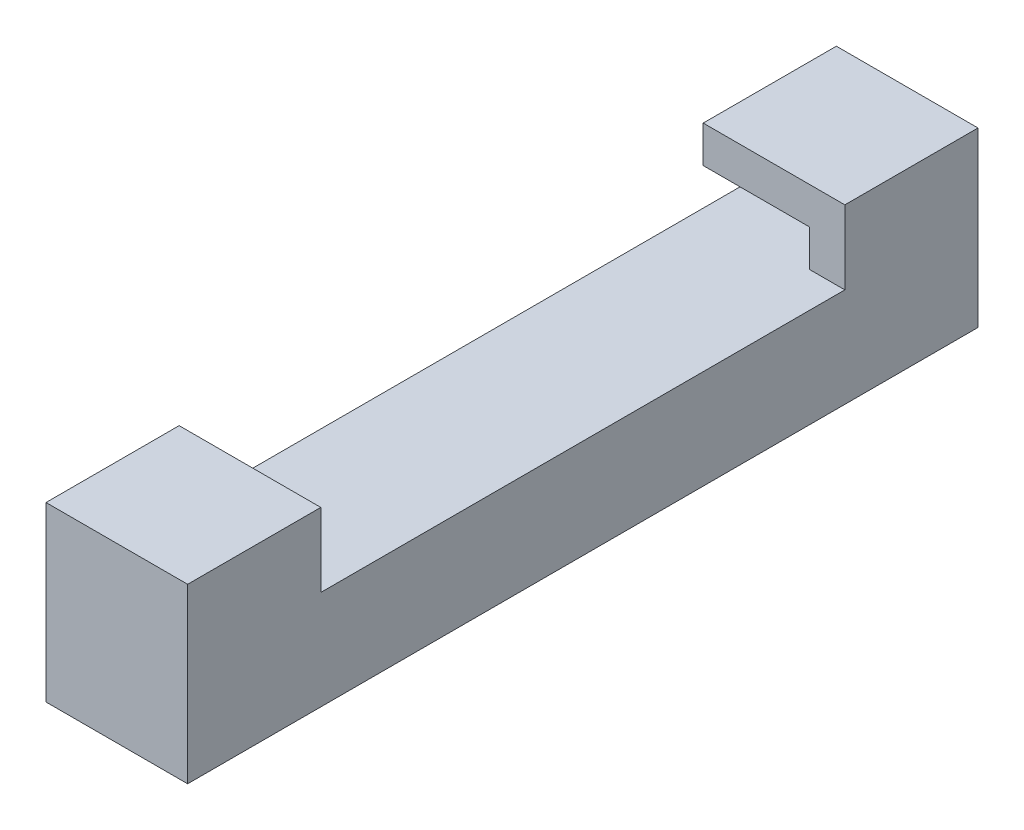
ISO-10303-21;
HEADER;
FILE_DESCRIPTION(('STEP AP214'),'2;1');
FILE_NAME('part.step','',(''),(''),'','','');
FILE_SCHEMA(('AUTOMOTIVE_DESIGN { 1 0 10303 214 1 1 1 1 }'));
ENDSEC;
DATA;
#1=APPLICATION_CONTEXT('core data for automotive mechanical design processes');
#2=APPLICATION_PROTOCOL_DEFINITION('international standard','automotive_design',2000,#1);
#3=PRODUCT_CONTEXT('',#1,'mechanical');
#4=PRODUCT('Part','Part','',(#3));
#5=PRODUCT_RELATED_PRODUCT_CATEGORY('part','',(#4));
#6=PRODUCT_DEFINITION_FORMATION('','',#4);
#7=PRODUCT_DEFINITION_CONTEXT('part definition',#1,'design');
#8=PRODUCT_DEFINITION('design','',#6,#7);
#9=PRODUCT_DEFINITION_SHAPE('','',#8);
#10=(LENGTH_UNIT() NAMED_UNIT(*) SI_UNIT(.MILLI.,.METRE.));
#11=(NAMED_UNIT(*) PLANE_ANGLE_UNIT() SI_UNIT($,.RADIAN.));
#12=(NAMED_UNIT(*) SI_UNIT($,.STERADIAN.) SOLID_ANGLE_UNIT());
#13=UNCERTAINTY_MEASURE_WITH_UNIT(LENGTH_MEASURE(1.E-05),#10,'distance_accuracy_value','');
#14=(GEOMETRIC_REPRESENTATION_CONTEXT(3) GLOBAL_UNCERTAINTY_ASSIGNED_CONTEXT((#13)) GLOBAL_UNIT_ASSIGNED_CONTEXT((#10,
#11,#12)) REPRESENTATION_CONTEXT('',''));
#15=CARTESIAN_POINT('',(0.,0.,0.));
#16=DIRECTION('',(0.,0.,1.));
#17=DIRECTION('',(1.,0.,0.));
#18=AXIS2_PLACEMENT_3D('',#15,#16,#17);
#19=CARTESIAN_POINT('',(12.7,12.192,-63.5));
#20=DIRECTION('',(0.,-1.,0.));
#21=DIRECTION('',(0.,0.,-1.));
#22=AXIS2_PLACEMENT_3D('',#19,#20,#21);
#23=PLANE('',#22);
#24=DIRECTION('',(-1.,0.,0.));
#25=VECTOR('',#24,1.);
#26=CARTESIAN_POINT('',(12.7,12.192,-70.612));
#27=LINE('',#26,#25);
#28=CARTESIAN_POINT('',(9.525,12.192,-70.612));
#29=VERTEX_POINT('',#28);
#30=CARTESIAN_POINT('',(0.,12.192,-70.612));
#31=VERTEX_POINT('',#30);
#32=EDGE_CURVE('E167',#29,#31,#27,.T.);
#33=ORIENTED_EDGE('',*,*,#32,.F.);
#34=DIRECTION('',(0.,0.,1.));
#35=VECTOR('',#34,1.);
#36=CARTESIAN_POINT('',(9.525,12.192,-70.612));
#37=LINE('',#36,#35);
#38=CARTESIAN_POINT('',(9.525,12.192,-63.5));
#39=VERTEX_POINT('',#38);
#40=EDGE_CURVE('E203',#29,#39,#37,.T.);
#41=ORIENTED_EDGE('',*,*,#40,.T.);
#42=DIRECTION('',(-1.,0.,0.));
#43=VECTOR('',#42,1.);
#44=CARTESIAN_POINT('',(12.7,12.192,-63.5));
#45=LINE('',#44,#43);
#46=CARTESIAN_POINT('',(0.,12.192,-63.5));
#47=VERTEX_POINT('',#46);
#48=EDGE_CURVE('E166',#39,#47,#45,.T.);
#49=ORIENTED_EDGE('',*,*,#48,.T.);
#50=DIRECTION('',(0.,0.,1.));
#51=VECTOR('',#50,1.);
#52=CARTESIAN_POINT('',(0.,12.192,-63.5));
#53=LINE('',#52,#51);
#54=EDGE_CURVE('E176',#31,#47,#53,.T.);
#55=ORIENTED_EDGE('',*,*,#54,.F.);
#56=EDGE_LOOP('',(#33,#41,#49,#55));
#57=FACE_BOUND('',#56,.T.);
#58=ADVANCED_FACE('F33',(#57),#23,.T.);
#59=CARTESIAN_POINT('',(12.7,8.89,-70.612));
#60=DIRECTION('',(0.,0.,1.));
#61=DIRECTION('',(1.,0.,0.));
#62=AXIS2_PLACEMENT_3D('',#59,#60,#61);
#63=PLANE('',#62);
#64=DIRECTION('',(-1.,0.,0.));
#65=VECTOR('',#64,1.);
#66=CARTESIAN_POINT('',(12.7,8.89,-70.612));
#67=LINE('',#66,#65);
#68=CARTESIAN_POINT('',(9.525,8.89,-70.612));
#69=VERTEX_POINT('',#68);
#70=CARTESIAN_POINT('',(0.,8.89,-70.612));
#71=VERTEX_POINT('',#70);
#72=EDGE_CURVE('E173',#69,#71,#67,.T.);
#73=ORIENTED_EDGE('',*,*,#72,.F.);
#74=DIRECTION('',(0.,1.,0.));
#75=VECTOR('',#74,1.);
#76=CARTESIAN_POINT('',(9.525,8.89,-70.612));
#77=LINE('',#76,#75);
#78=EDGE_CURVE('E209',#69,#29,#77,.T.);
#79=ORIENTED_EDGE('',*,*,#78,.T.);
#80=ORIENTED_EDGE('',*,*,#32,.T.);
#81=DIRECTION('',(0.,1.,0.));
#82=VECTOR('',#81,1.);
#83=CARTESIAN_POINT('',(0.,8.89,-70.612));
#84=LINE('',#83,#82);
#85=EDGE_CURVE('E195',#71,#31,#84,.T.);
#86=ORIENTED_EDGE('',*,*,#85,.F.);
#87=EDGE_LOOP('',(#73,#79,#80,#86));
#88=FACE_BOUND('',#87,.T.);
#89=ADVANCED_FACE('F287',(#88),#63,.T.);
#90=CARTESIAN_POINT('',(12.7,0.,0.));
#91=DIRECTION('',(0.,1.,0.));
#92=DIRECTION('',(0.,0.,1.));
#93=AXIS2_PLACEMENT_3D('',#90,#91,#92);
#94=PLANE('',#93);
#95=DIRECTION('',(0.,0.,-1.));
#96=VECTOR('',#95,1.);
#97=CARTESIAN_POINT('',(12.7,0.,0.));
#98=LINE('',#97,#96);
#99=CARTESIAN_POINT('',(12.7,0.,-4.572));
#100=VERTEX_POINT('',#99);
#101=CARTESIAN_POINT('',(12.7,0.,-75.438));
#102=VERTEX_POINT('',#101);
#103=EDGE_CURVE('E42',#100,#102,#98,.T.);
#104=ORIENTED_EDGE('',*,*,#103,.F.);
#105=DIRECTION('',(-1.,0.,0.));
#106=VECTOR('',#105,1.);
#107=CARTESIAN_POINT('',(12.701,0.,-4.572));
#108=LINE('',#107,#106);
#109=CARTESIAN_POINT('',(0.,0.,-4.572));
#110=VERTEX_POINT('',#109);
#111=EDGE_CURVE('E136',#100,#110,#108,.T.);
#112=ORIENTED_EDGE('',*,*,#111,.T.);
#113=DIRECTION('',(0.,0.,-1.));
#114=VECTOR('',#113,1.);
#115=CARTESIAN_POINT('',(0.,0.,0.));
#116=LINE('',#115,#114);
#117=CARTESIAN_POINT('',(0.,0.,-75.438));
#118=VERTEX_POINT('',#117);
#119=EDGE_CURVE('E162',#110,#118,#116,.T.);
#120=ORIENTED_EDGE('',*,*,#119,.T.);
#121=DIRECTION('',(-1.,0.,0.));
#122=VECTOR('',#121,1.);
#123=CARTESIAN_POINT('',(12.701,0.,-75.438));
#124=LINE('',#123,#122);
#125=EDGE_CURVE('E159',#102,#118,#124,.T.);
#126=ORIENTED_EDGE('',*,*,#125,.F.);
#127=EDGE_LOOP('',(#104,#112,#120,#126));
#128=FACE_BOUND('',#127,.T.);
#129=ADVANCED_FACE('F35',(#128),#94,.F.);
#130=CARTESIAN_POINT('',(12.7,8.89,-71.12));
#131=DIRECTION('',(0.,-1.,0.));
#132=DIRECTION('',(0.,0.,-1.));
#133=AXIS2_PLACEMENT_3D('',#130,#131,#132);
#134=PLANE('',#133);
#135=DIRECTION('',(0.,0.,1.));
#136=VECTOR('',#135,1.);
#137=CARTESIAN_POINT('',(12.7,8.89,-71.12));
#138=LINE('',#137,#136);
#139=CARTESIAN_POINT('',(12.7,8.89,-63.5));
#140=VERTEX_POINT('',#139);
#141=CARTESIAN_POINT('',(12.7,8.88999999999999,-16.51));
#142=VERTEX_POINT('',#141);
#143=EDGE_CURVE('E11',#140,#142,#138,.T.);
#144=ORIENTED_EDGE('',*,*,#143,.F.);
#145=DIRECTION('',(1.,0.,0.));
#146=VECTOR('',#145,1.);
#147=CARTESIAN_POINT('',(9.525,8.89,-63.5));
#148=LINE('',#147,#146);
#149=CARTESIAN_POINT('',(9.525,8.89,-63.5));
#150=VERTEX_POINT('',#149);
#151=EDGE_CURVE('E50',#150,#140,#148,.T.);
#152=ORIENTED_EDGE('',*,*,#151,.F.);
#153=DIRECTION('',(0.,0.,-1.));
#154=VECTOR('',#153,1.);
#155=CARTESIAN_POINT('',(9.525,8.89,-63.5));
#156=LINE('',#155,#154);
#157=EDGE_CURVE('E213',#150,#69,#156,.T.);
#158=ORIENTED_EDGE('',*,*,#157,.T.);
#159=ORIENTED_EDGE('',*,*,#72,.T.);
#160=DIRECTION('',(0.,0.,1.));
#161=VECTOR('',#160,1.);
#162=CARTESIAN_POINT('',(0.,8.89,-71.12));
#163=LINE('',#162,#161);
#164=CARTESIAN_POINT('',(0.,8.88999999999999,-9.398));
#165=VERTEX_POINT('',#164);
#166=EDGE_CURVE('E37',#71,#165,#163,.T.);
#167=ORIENTED_EDGE('',*,*,#166,.T.);
#168=DIRECTION('',(-1.,0.,0.));
#169=VECTOR('',#168,1.);
#170=CARTESIAN_POINT('',(12.7,8.88999999999999,-9.398));
#171=LINE('',#170,#169);
#172=CARTESIAN_POINT('',(9.525,8.88999999999999,-9.398));
#173=VERTEX_POINT('',#172);
#174=EDGE_CURVE('E257',#173,#165,#171,.T.);
#175=ORIENTED_EDGE('',*,*,#174,.F.);
#176=DIRECTION('',(0.,0.,-1.));
#177=VECTOR('',#176,1.);
#178=CARTESIAN_POINT('',(9.525,8.88999999999999,-16.51));
#179=LINE('',#178,#177);
#180=CARTESIAN_POINT('',(9.525,8.88999999999999,-16.51));
#181=VERTEX_POINT('',#180);
#182=EDGE_CURVE('E223',#173,#181,#179,.T.);
#183=ORIENTED_EDGE('',*,*,#182,.T.);
#184=DIRECTION('',(1.,0.,0.));
#185=VECTOR('',#184,1.);
#186=CARTESIAN_POINT('',(9.525,8.88999999999999,-16.51));
#187=LINE('',#186,#185);
#188=EDGE_CURVE('E155',#181,#142,#187,.T.);
#189=ORIENTED_EDGE('',*,*,#188,.T.);
#190=EDGE_LOOP('',(#144,#152,#158,#159,#167,#175,#183,#189));
#191=FACE_BOUND('',#190,.T.);
#192=ADVANCED_FACE('F274',(#191),#134,.F.);
#193=CARTESIAN_POINT('',(12.7,0.,0.));
#194=DIRECTION('',(1.,0.,0.));
#195=DIRECTION('',(0.,0.,-1.));
#196=AXIS2_PLACEMENT_3D('',#193,#194,#195);
#197=PLANE('',#196);
#198=DIRECTION('',(0.,1.,0.));
#199=VECTOR('',#198,1.);
#200=CARTESIAN_POINT('',(12.7,12.192,-63.5));
#201=LINE('',#200,#199);
#202=CARTESIAN_POINT('',(12.7,15.494,-63.5));
#203=VERTEX_POINT('',#202);
#204=EDGE_CURVE('E57',#140,#203,#201,.T.);
#205=ORIENTED_EDGE('',*,*,#204,.F.);
#206=ORIENTED_EDGE('',*,*,#143,.T.);
#207=DIRECTION('',(0.,-1.,0.));
#208=VECTOR('',#207,1.);
#209=CARTESIAN_POINT('',(12.7,12.192,-16.51));
#210=LINE('',#209,#208);
#211=CARTESIAN_POINT('',(12.7,15.494,-16.51));
#212=VERTEX_POINT('',#211);
#213=EDGE_CURVE('E240',#212,#142,#210,.T.);
#214=ORIENTED_EDGE('',*,*,#213,.F.);
#215=DIRECTION('',(0.,0.,-1.));
#216=VECTOR('',#215,1.);
#217=CARTESIAN_POINT('',(12.7,15.494,-16.51));
#218=LINE('',#217,#216);
#219=CARTESIAN_POINT('',(12.7,15.494,-4.572));
#220=VERTEX_POINT('',#219);
#221=EDGE_CURVE('E154',#220,#212,#218,.T.);
#222=ORIENTED_EDGE('',*,*,#221,.F.);
#223=DIRECTION('',(0.,-1.,0.));
#224=VECTOR('',#223,1.);
#225=CARTESIAN_POINT('',(12.7,15.494,-4.572));
#226=LINE('',#225,#224);
#227=EDGE_CURVE('E140',#220,#100,#226,.T.);
#228=ORIENTED_EDGE('',*,*,#227,.T.);
#229=ORIENTED_EDGE('',*,*,#103,.T.);
#230=DIRECTION('',(0.,1.,0.));
#231=VECTOR('',#230,1.);
#232=CARTESIAN_POINT('',(12.7,15.494,-75.438));
#233=LINE('',#232,#231);
#234=CARTESIAN_POINT('',(12.7,15.494,-75.438));
#235=VERTEX_POINT('',#234);
#236=EDGE_CURVE('E147',#102,#235,#233,.T.);
#237=ORIENTED_EDGE('',*,*,#236,.T.);
#238=DIRECTION('',(0.,0.,-1.));
#239=VECTOR('',#238,1.);
#240=CARTESIAN_POINT('',(12.7,15.494,-63.5));
#241=LINE('',#240,#239);
#242=EDGE_CURVE('E180',#203,#235,#241,.T.);
#243=ORIENTED_EDGE('',*,*,#242,.F.);
#244=EDGE_LOOP('',(#205,#206,#214,#222,#228,#229,#237,#243));
#245=FACE_BOUND('',#244,.T.);
#246=ADVANCED_FACE('F150',(#245),#197,.T.);
#247=CARTESIAN_POINT('',(0.,0.,0.));
#248=DIRECTION('',(1.,0.,0.));
#249=DIRECTION('',(0.,0.,-1.));
#250=AXIS2_PLACEMENT_3D('',#247,#248,#249);
#251=PLANE('',#250);
#252=ORIENTED_EDGE('',*,*,#119,.F.);
#253=DIRECTION('',(0.,-1.,0.));
#254=VECTOR('',#253,1.);
#255=CARTESIAN_POINT('',(0.,15.494,-4.572));
#256=LINE('',#255,#254);
#257=CARTESIAN_POINT('',(0.,15.494,-4.572));
#258=VERTEX_POINT('',#257);
#259=EDGE_CURVE('E143',#258,#110,#256,.T.);
#260=ORIENTED_EDGE('',*,*,#259,.F.);
#261=DIRECTION('',(0.,0.,-1.));
#262=VECTOR('',#261,1.);
#263=CARTESIAN_POINT('',(0.,15.494,-16.51));
#264=LINE('',#263,#262);
#265=CARTESIAN_POINT('',(0.,15.494,-16.51));
#266=VERTEX_POINT('',#265);
#267=EDGE_CURVE('E243',#258,#266,#264,.T.);
#268=ORIENTED_EDGE('',*,*,#267,.T.);
#269=DIRECTION('',(0.,-1.,0.));
#270=VECTOR('',#269,1.);
#271=CARTESIAN_POINT('',(0.,12.192,-16.51));
#272=LINE('',#271,#270);
#273=CARTESIAN_POINT('',(0.,12.192,-16.51));
#274=VERTEX_POINT('',#273);
#275=EDGE_CURVE('E238',#266,#274,#272,.T.);
#276=ORIENTED_EDGE('',*,*,#275,.T.);
#277=DIRECTION('',(0.,0.,1.));
#278=VECTOR('',#277,1.);
#279=CARTESIAN_POINT('',(0.,12.192,-16.51));
#280=LINE('',#279,#278);
#281=CARTESIAN_POINT('',(0.,12.192,-9.398));
#282=VERTEX_POINT('',#281);
#283=EDGE_CURVE('E248',#274,#282,#280,.T.);
#284=ORIENTED_EDGE('',*,*,#283,.T.);
#285=DIRECTION('',(0.,-1.,0.));
#286=VECTOR('',#285,1.);
#287=CARTESIAN_POINT('',(0.,8.88999999999999,-9.398));
#288=LINE('',#287,#286);
#289=EDGE_CURVE('E251',#282,#165,#288,.T.);
#290=ORIENTED_EDGE('',*,*,#289,.T.);
#291=ORIENTED_EDGE('',*,*,#166,.F.);
#292=ORIENTED_EDGE('',*,*,#85,.T.);
#293=ORIENTED_EDGE('',*,*,#54,.T.);
#294=DIRECTION('',(0.,1.,0.));
#295=VECTOR('',#294,1.);
#296=CARTESIAN_POINT('',(0.,12.192,-63.5));
#297=LINE('',#296,#295);
#298=CARTESIAN_POINT('',(0.,15.494,-63.5));
#299=VERTEX_POINT('',#298);
#300=EDGE_CURVE('E190',#47,#299,#297,.T.);
#301=ORIENTED_EDGE('',*,*,#300,.T.);
#302=DIRECTION('',(0.,0.,-1.));
#303=VECTOR('',#302,1.);
#304=CARTESIAN_POINT('',(0.,15.494,-63.5));
#305=LINE('',#304,#303);
#306=CARTESIAN_POINT('',(0.,15.494,-75.438));
#307=VERTEX_POINT('',#306);
#308=EDGE_CURVE('E193',#299,#307,#305,.T.);
#309=ORIENTED_EDGE('',*,*,#308,.T.);
#310=DIRECTION('',(0.,1.,0.));
#311=VECTOR('',#310,1.);
#312=CARTESIAN_POINT('',(0.,15.494,-75.438));
#313=LINE('',#312,#311);
#314=EDGE_CURVE('E233',#118,#307,#313,.T.);
#315=ORIENTED_EDGE('',*,*,#314,.F.);
#316=EDGE_LOOP('',(#252,#260,#268,#276,#284,#290,#291,#292,#293,#301,#309,#315));
#317=FACE_BOUND('',#316,.T.);
#318=ADVANCED_FACE('F200',(#317),#251,.F.);
#319=CARTESIAN_POINT('',(12.7,15.494,-63.5));
#320=DIRECTION('',(0.,1.,0.));
#321=DIRECTION('',(0.,0.,1.));
#322=AXIS2_PLACEMENT_3D('',#319,#320,#321);
#323=PLANE('',#322);
#324=ORIENTED_EDGE('',*,*,#242,.T.);
#325=DIRECTION('',(-1.,0.,0.));
#326=VECTOR('',#325,1.);
#327=CARTESIAN_POINT('',(12.701,15.494,-75.438));
#328=LINE('',#327,#326);
#329=EDGE_CURVE('E236',#235,#307,#328,.T.);
#330=ORIENTED_EDGE('',*,*,#329,.T.);
#331=ORIENTED_EDGE('',*,*,#308,.F.);
#332=DIRECTION('',(-1.,0.,0.));
#333=VECTOR('',#332,1.);
#334=CARTESIAN_POINT('',(12.7,15.494,-63.5));
#335=LINE('',#334,#333);
#336=EDGE_CURVE('E164',#203,#299,#335,.T.);
#337=ORIENTED_EDGE('',*,*,#336,.F.);
#338=EDGE_LOOP('',(#324,#330,#331,#337));
#339=FACE_BOUND('',#338,.T.);
#340=ADVANCED_FACE('F277',(#339),#323,.T.);
#341=CARTESIAN_POINT('',(12.7,12.192,-63.5));
#342=DIRECTION('',(0.,0.,1.));
#343=DIRECTION('',(1.,0.,0.));
#344=AXIS2_PLACEMENT_3D('',#341,#342,#343);
#345=PLANE('',#344);
#346=ORIENTED_EDGE('',*,*,#300,.F.);
#347=ORIENTED_EDGE('',*,*,#48,.F.);
#348=DIRECTION('',(0.,-1.,0.));
#349=VECTOR('',#348,1.);
#350=CARTESIAN_POINT('',(9.525,12.192,-63.5));
#351=LINE('',#350,#349);
#352=EDGE_CURVE('E211',#39,#150,#351,.T.);
#353=ORIENTED_EDGE('',*,*,#352,.T.);
#354=ORIENTED_EDGE('',*,*,#151,.T.);
#355=ORIENTED_EDGE('',*,*,#204,.T.);
#356=ORIENTED_EDGE('',*,*,#336,.T.);
#357=EDGE_LOOP('',(#346,#347,#353,#354,#355,#356));
#358=FACE_BOUND('',#357,.T.);
#359=ADVANCED_FACE('F275',(#358),#345,.T.);
#360=CARTESIAN_POINT('',(12.7,15.494,-16.51));
#361=DIRECTION('',(0.,1.,0.));
#362=DIRECTION('',(0.,0.,1.));
#363=AXIS2_PLACEMENT_3D('',#360,#361,#362);
#364=PLANE('',#363);
#365=ORIENTED_EDGE('',*,*,#267,.F.);
#366=DIRECTION('',(-1.,0.,0.));
#367=VECTOR('',#366,1.);
#368=CARTESIAN_POINT('',(12.701,15.494,-4.572));
#369=LINE('',#368,#367);
#370=EDGE_CURVE('E148',#220,#258,#369,.T.);
#371=ORIENTED_EDGE('',*,*,#370,.F.);
#372=ORIENTED_EDGE('',*,*,#221,.T.);
#373=DIRECTION('',(-1.,0.,0.));
#374=VECTOR('',#373,1.);
#375=CARTESIAN_POINT('',(12.7,15.494,-16.51));
#376=LINE('',#375,#374);
#377=EDGE_CURVE('E194',#212,#266,#376,.T.);
#378=ORIENTED_EDGE('',*,*,#377,.T.);
#379=EDGE_LOOP('',(#365,#371,#372,#378));
#380=FACE_BOUND('',#379,.T.);
#381=ADVANCED_FACE('F273',(#380),#364,.T.);
#382=CARTESIAN_POINT('',(12.7,12.192,-16.51));
#383=DIRECTION('',(0.,0.,-1.));
#384=DIRECTION('',(-1.,0.,0.));
#385=AXIS2_PLACEMENT_3D('',#382,#383,#384);
#386=PLANE('',#385);
#387=ORIENTED_EDGE('',*,*,#275,.F.);
#388=ORIENTED_EDGE('',*,*,#377,.F.);
#389=ORIENTED_EDGE('',*,*,#213,.T.);
#390=ORIENTED_EDGE('',*,*,#188,.F.);
#391=DIRECTION('',(0.,1.,0.));
#392=VECTOR('',#391,1.);
#393=CARTESIAN_POINT('',(9.525,12.192,-16.51));
#394=LINE('',#393,#392);
#395=CARTESIAN_POINT('',(9.525,12.192,-16.51));
#396=VERTEX_POINT('',#395);
#397=EDGE_CURVE('E225',#181,#396,#394,.T.);
#398=ORIENTED_EDGE('',*,*,#397,.T.);
#399=DIRECTION('',(-1.,0.,0.));
#400=VECTOR('',#399,1.);
#401=CARTESIAN_POINT('',(12.7,12.192,-16.51));
#402=LINE('',#401,#400);
#403=EDGE_CURVE('E245',#396,#274,#402,.T.);
#404=ORIENTED_EDGE('',*,*,#403,.T.);
#405=EDGE_LOOP('',(#387,#388,#389,#390,#398,#404));
#406=FACE_BOUND('',#405,.T.);
#407=ADVANCED_FACE('F263',(#406),#386,.T.);
#408=CARTESIAN_POINT('',(12.7,8.88999999999999,-9.398));
#409=DIRECTION('',(0.,0.,-1.));
#410=DIRECTION('',(-1.,0.,0.));
#411=AXIS2_PLACEMENT_3D('',#408,#409,#410);
#412=PLANE('',#411);
#413=DIRECTION('',(0.,-1.,0.));
#414=VECTOR('',#413,1.);
#415=CARTESIAN_POINT('',(9.525,8.88999999999999,-9.398));
#416=LINE('',#415,#414);
#417=CARTESIAN_POINT('',(9.525,12.192,-9.398));
#418=VERTEX_POINT('',#417);
#419=EDGE_CURVE('E221',#418,#173,#416,.T.);
#420=ORIENTED_EDGE('',*,*,#419,.T.);
#421=ORIENTED_EDGE('',*,*,#174,.T.);
#422=ORIENTED_EDGE('',*,*,#289,.F.);
#423=DIRECTION('',(-1.,0.,0.));
#424=VECTOR('',#423,1.);
#425=CARTESIAN_POINT('',(12.7,12.192,-9.398));
#426=LINE('',#425,#424);
#427=EDGE_CURVE('E259',#418,#282,#426,.T.);
#428=ORIENTED_EDGE('',*,*,#427,.F.);
#429=EDGE_LOOP('',(#420,#421,#422,#428));
#430=FACE_BOUND('',#429,.T.);
#431=ADVANCED_FACE('F296',(#430),#412,.T.);
#432=CARTESIAN_POINT('',(12.7,12.192,-16.51));
#433=DIRECTION('',(0.,-1.,0.));
#434=DIRECTION('',(0.,0.,-1.));
#435=AXIS2_PLACEMENT_3D('',#432,#433,#434);
#436=PLANE('',#435);
#437=DIRECTION('',(0.,0.,1.));
#438=VECTOR('',#437,1.);
#439=CARTESIAN_POINT('',(9.525,12.192,-9.398));
#440=LINE('',#439,#438);
#441=EDGE_CURVE('E219',#396,#418,#440,.T.);
#442=ORIENTED_EDGE('',*,*,#441,.T.);
#443=ORIENTED_EDGE('',*,*,#427,.T.);
#444=ORIENTED_EDGE('',*,*,#283,.F.);
#445=ORIENTED_EDGE('',*,*,#403,.F.);
#446=EDGE_LOOP('',(#442,#443,#444,#445));
#447=FACE_BOUND('',#446,.T.);
#448=ADVANCED_FACE('F269',(#447),#436,.T.);
#449=CARTESIAN_POINT('',(12.701,15.494,-75.438));
#450=DIRECTION('',(0.,0.,1.));
#451=DIRECTION('',(1.,0.,0.));
#452=AXIS2_PLACEMENT_3D('',#449,#450,#451);
#453=PLANE('',#452);
#454=ORIENTED_EDGE('',*,*,#125,.T.);
#455=ORIENTED_EDGE('',*,*,#314,.T.);
#456=ORIENTED_EDGE('',*,*,#329,.F.);
#457=ORIENTED_EDGE('',*,*,#236,.F.);
#458=EDGE_LOOP('',(#454,#455,#456,#457));
#459=FACE_BOUND('',#458,.T.);
#460=ADVANCED_FACE('F299',(#459),#453,.F.);
#461=CARTESIAN_POINT('',(12.701,15.494,-4.572));
#462=DIRECTION('',(0.,0.,-1.));
#463=DIRECTION('',(0.,1.,0.));
#464=AXIS2_PLACEMENT_3D('',#461,#462,#463);
#465=PLANE('',#464);
#466=ORIENTED_EDGE('',*,*,#370,.T.);
#467=ORIENTED_EDGE('',*,*,#259,.T.);
#468=ORIENTED_EDGE('',*,*,#111,.F.);
#469=ORIENTED_EDGE('',*,*,#227,.F.);
#470=EDGE_LOOP('',(#466,#467,#468,#469));
#471=FACE_BOUND('',#470,.T.);
#472=ADVANCED_FACE('F139',(#471),#465,.F.);
#473=CARTESIAN_POINT('',(9.525,0.,0.));
#474=DIRECTION('',(-1.,0.,0.));
#475=DIRECTION('',(0.,0.,1.));
#476=AXIS2_PLACEMENT_3D('',#473,#474,#475);
#477=PLANE('',#476);
#478=ORIENTED_EDGE('',*,*,#441,.F.);
#479=ORIENTED_EDGE('',*,*,#397,.F.);
#480=ORIENTED_EDGE('',*,*,#182,.F.);
#481=ORIENTED_EDGE('',*,*,#419,.F.);
#482=EDGE_LOOP('',(#478,#479,#480,#481));
#483=FACE_BOUND('',#482,.T.);
#484=ADVANCED_FACE('F308',(#483),#477,.T.);
#485=CARTESIAN_POINT('',(9.525,0.,0.));
#486=DIRECTION('',(1.,0.,0.));
#487=DIRECTION('',(0.,0.,-1.));
#488=AXIS2_PLACEMENT_3D('',#485,#486,#487);
#489=PLANE('',#488);
#490=ORIENTED_EDGE('',*,*,#40,.F.);
#491=ORIENTED_EDGE('',*,*,#78,.F.);
#492=ORIENTED_EDGE('',*,*,#157,.F.);
#493=ORIENTED_EDGE('',*,*,#352,.F.);
#494=EDGE_LOOP('',(#490,#491,#492,#493));
#495=FACE_BOUND('',#494,.T.);
#496=ADVANCED_FACE('F208',(#495),#489,.F.);
#497=CLOSED_SHELL('',(#58,#89,#129,#192,#246,#318,#340,#359,#381,#407,#431,#448,#460,#472,#484,#496));
#498=MANIFOLD_SOLID_BREP('B2',#497);
#499=ADVANCED_BREP_SHAPE_REPRESENTATION('',(#18,#498),#14);
#500=SHAPE_DEFINITION_REPRESENTATION(#9,#499);
ENDSEC;
END-ISO-10303-21;
